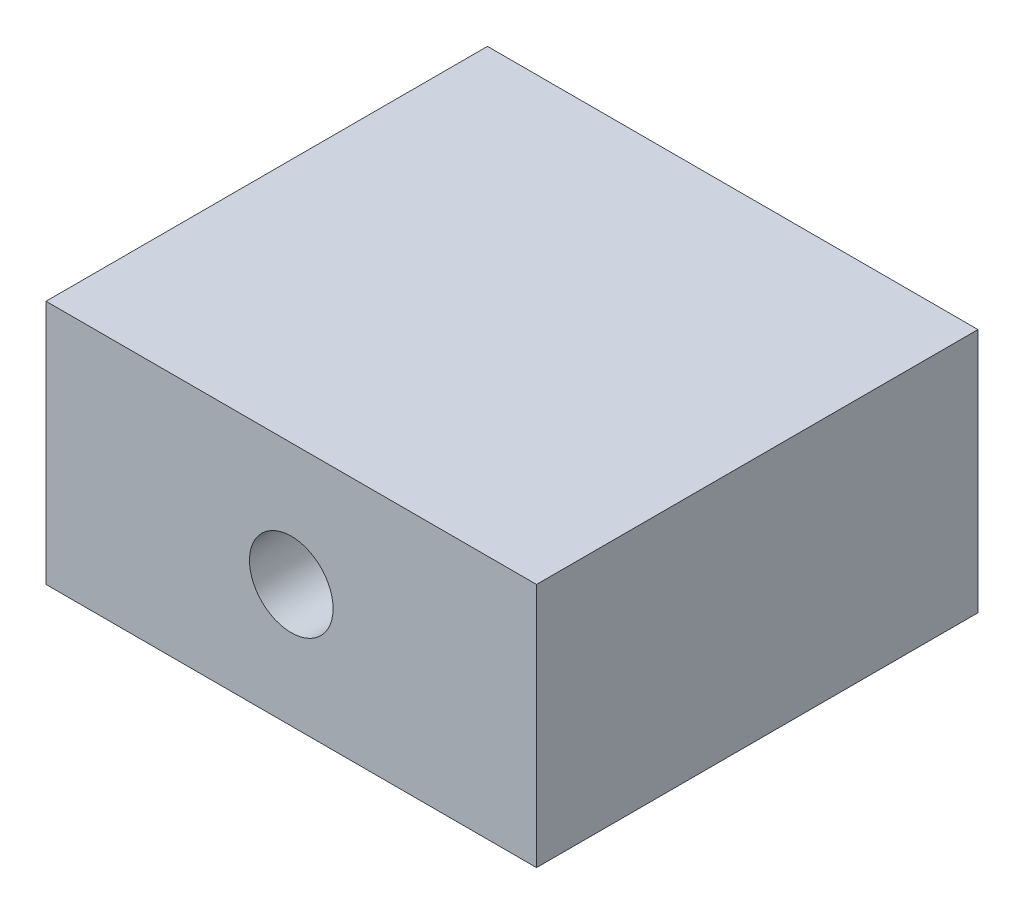
ISO-10303-21;
HEADER;
FILE_DESCRIPTION(('STEP AP214'),'2;1');
FILE_NAME('part.step','',(''),(''),'','','');
FILE_SCHEMA(('AUTOMOTIVE_DESIGN { 1 0 10303 214 1 1 1 1 }'));
ENDSEC;
DATA;
#1=APPLICATION_CONTEXT('core data for automotive mechanical design processes');
#2=APPLICATION_PROTOCOL_DEFINITION('international standard','automotive_design',2000,#1);
#3=PRODUCT_CONTEXT('',#1,'mechanical');
#4=PRODUCT('Part','Part','',(#3));
#5=PRODUCT_RELATED_PRODUCT_CATEGORY('part','',(#4));
#6=PRODUCT_DEFINITION_FORMATION('','',#4);
#7=PRODUCT_DEFINITION_CONTEXT('part definition',#1,'design');
#8=PRODUCT_DEFINITION('design','',#6,#7);
#9=PRODUCT_DEFINITION_SHAPE('','',#8);
#10=(LENGTH_UNIT() NAMED_UNIT(*) SI_UNIT(.MILLI.,.METRE.));
#11=(NAMED_UNIT(*) PLANE_ANGLE_UNIT() SI_UNIT($,.RADIAN.));
#12=(NAMED_UNIT(*) SI_UNIT($,.STERADIAN.) SOLID_ANGLE_UNIT());
#13=UNCERTAINTY_MEASURE_WITH_UNIT(LENGTH_MEASURE(1.E-05),#10,'distance_accuracy_value','');
#14=(GEOMETRIC_REPRESENTATION_CONTEXT(3) GLOBAL_UNCERTAINTY_ASSIGNED_CONTEXT((#13)) GLOBAL_UNIT_ASSIGNED_CONTEXT((#10,
#11,#12)) REPRESENTATION_CONTEXT('',''));
#15=CARTESIAN_POINT('',(0.,0.,0.));
#16=DIRECTION('',(0.,0.,1.));
#17=DIRECTION('',(1.,0.,0.));
#18=AXIS2_PLACEMENT_3D('',#15,#16,#17);
#19=CARTESIAN_POINT('',(0.,0.,0.));
#20=DIRECTION('',(0.,-1.,0.));
#21=DIRECTION('',(0.,0.,-1.));
#22=AXIS2_PLACEMENT_3D('',#19,#20,#21);
#23=PLANE('',#22);
#24=DIRECTION('',(-1.,0.,0.));
#25=VECTOR('',#24,1.);
#26=CARTESIAN_POINT('',(-28.,0.,20.));
#27=LINE('',#26,#25);
#28=CARTESIAN_POINT('',(-8.,0.,20.));
#29=VERTEX_POINT('',#28);
#30=CARTESIAN_POINT('',(-28.,0.,20.));
#31=VERTEX_POINT('',#30);
#32=EDGE_CURVE('E153',#29,#31,#27,.T.);
#33=ORIENTED_EDGE('',*,*,#32,.F.);
#34=DIRECTION('',(0.,0.,-1.));
#35=VECTOR('',#34,1.);
#36=CARTESIAN_POINT('',(-8.,0.,20.));
#37=LINE('',#36,#35);
#38=CARTESIAN_POINT('',(-8.,0.,38.));
#39=VERTEX_POINT('',#38);
#40=EDGE_CURVE('E86',#39,#29,#37,.T.);
#41=ORIENTED_EDGE('',*,*,#40,.F.);
#42=DIRECTION('',(1.,0.,0.));
#43=VECTOR('',#42,1.);
#44=CARTESIAN_POINT('',(-8.,0.,38.));
#45=LINE('',#44,#43);
#46=CARTESIAN_POINT('',(-28.,0.,38.));
#47=VERTEX_POINT('',#46);
#48=EDGE_CURVE('E171',#47,#39,#45,.T.);
#49=ORIENTED_EDGE('',*,*,#48,.F.);
#50=DIRECTION('',(0.,0.,1.));
#51=VECTOR('',#50,1.);
#52=CARTESIAN_POINT('',(-28.,0.,38.));
#53=LINE('',#52,#51);
#54=EDGE_CURVE('E168',#31,#47,#53,.T.);
#55=ORIENTED_EDGE('',*,*,#54,.F.);
#56=EDGE_LOOP('',(#33,#41,#49,#55));
#57=FACE_BOUND('',#56,.T.);
#58=DIRECTION('',(0.,0.,-1.));
#59=VECTOR('',#58,1.);
#60=CARTESIAN_POINT('',(-21.65,0.,31.));
#61=LINE('',#60,#59);
#62=CARTESIAN_POINT('',(-21.65,0.,31.));
#63=VERTEX_POINT('',#62);
#64=CARTESIAN_POINT('',(-21.65,0.,23.));
#65=VERTEX_POINT('',#64);
#66=EDGE_CURVE('E131',#63,#65,#61,.T.);
#67=ORIENTED_EDGE('',*,*,#66,.F.);
#68=DIRECTION('',(1.,0.,0.));
#69=VECTOR('',#68,1.);
#70=CARTESIAN_POINT('',(-21.65,0.,31.));
#71=LINE('',#70,#69);
#72=CARTESIAN_POINT('',(-14.35,0.,31.));
#73=VERTEX_POINT('',#72);
#74=EDGE_CURVE('E116',#63,#73,#71,.T.);
#75=ORIENTED_EDGE('',*,*,#74,.T.);
#76=DIRECTION('',(0.,0.,-1.));
#77=VECTOR('',#76,1.);
#78=CARTESIAN_POINT('',(-14.35,0.,31.));
#79=LINE('',#78,#77);
#80=CARTESIAN_POINT('',(-14.35,0.,23.));
#81=VERTEX_POINT('',#80);
#82=EDGE_CURVE('E140',#73,#81,#79,.T.);
#83=ORIENTED_EDGE('',*,*,#82,.T.);
#84=DIRECTION('',(1.,0.,0.));
#85=VECTOR('',#84,1.);
#86=CARTESIAN_POINT('',(-21.65,0.,23.));
#87=LINE('',#86,#85);
#88=EDGE_CURVE('E138',#65,#81,#87,.T.);
#89=ORIENTED_EDGE('',*,*,#88,.F.);
#90=EDGE_LOOP('',(#67,#75,#83,#89));
#91=FACE_BOUND('',#90,.T.);
#92=ADVANCED_FACE('F39',(#57,#91),#23,.T.);
#93=CARTESIAN_POINT('',(-18.,5.,23.));
#94=DIRECTION('',(0.,0.,1.));
#95=DIRECTION('',(1.,0.,0.));
#96=AXIS2_PLACEMENT_3D('',#93,#94,#95);
#97=CYLINDRICAL_SURFACE('',#96,1.705);
#98=CARTESIAN_POINT('',(-18.,5.,38.));
#99=DIRECTION('',(0.,0.,1.));
#100=DIRECTION('',(1.,0.,0.));
#101=AXIS2_PLACEMENT_3D('',#98,#99,#100);
#102=CIRCLE('',#101,1.705);
#103=CARTESIAN_POINT('',(-16.295,5.,38.));
#104=VERTEX_POINT('',#103);
#105=EDGE_CURVE('E145',#104,#104,#102,.T.);
#106=ORIENTED_EDGE('',*,*,#105,.T.);
#107=EDGE_LOOP('',(#106));
#108=FACE_BOUND('',#107,.T.);
#109=CARTESIAN_POINT('',(-18.,5.,31.));
#110=DIRECTION('',(0.,0.,-1.));
#111=DIRECTION('',(-1.,0.,0.));
#112=AXIS2_PLACEMENT_3D('',#109,#110,#111);
#113=CIRCLE('',#112,1.705);
#114=CARTESIAN_POINT('',(-19.705,5.,31.));
#115=VERTEX_POINT('',#114);
#116=EDGE_CURVE('E43',#115,#115,#113,.F.);
#117=ORIENTED_EDGE('',*,*,#116,.F.);
#118=EDGE_LOOP('',(#117));
#119=FACE_BOUND('',#118,.T.);
#120=ADVANCED_FACE('F207',(#108,#119),#97,.F.);
#121=CARTESIAN_POINT('',(-28.,10.,20.));
#122=DIRECTION('',(0.,0.,1.));
#123=DIRECTION('',(1.,0.,0.));
#124=AXIS2_PLACEMENT_3D('',#121,#122,#123);
#125=PLANE('',#124);
#126=ORIENTED_EDGE('',*,*,#32,.T.);
#127=DIRECTION('',(0.,-1.,0.));
#128=VECTOR('',#127,1.);
#129=CARTESIAN_POINT('',(-28.,10.,20.));
#130=LINE('',#129,#128);
#131=CARTESIAN_POINT('',(-28.,10.,20.));
#132=VERTEX_POINT('',#131);
#133=EDGE_CURVE('E11',#132,#31,#130,.T.);
#134=ORIENTED_EDGE('',*,*,#133,.F.);
#135=DIRECTION('',(-1.,0.,0.));
#136=VECTOR('',#135,1.);
#137=CARTESIAN_POINT('',(-28.,10.,20.));
#138=LINE('',#137,#136);
#139=CARTESIAN_POINT('',(-8.,10.,20.));
#140=VERTEX_POINT('',#139);
#141=EDGE_CURVE('E154',#140,#132,#138,.T.);
#142=ORIENTED_EDGE('',*,*,#141,.F.);
#143=DIRECTION('',(0.,-1.,0.));
#144=VECTOR('',#143,1.);
#145=CARTESIAN_POINT('',(-8.,10.,20.));
#146=LINE('',#145,#144);
#147=EDGE_CURVE('E164',#140,#29,#146,.T.);
#148=ORIENTED_EDGE('',*,*,#147,.T.);
#149=EDGE_LOOP('',(#126,#134,#142,#148));
#150=FACE_BOUND('',#149,.T.);
#151=ADVANCED_FACE('F41',(#150),#125,.F.);
#152=CARTESIAN_POINT('',(-28.,10.,38.));
#153=DIRECTION('',(1.,0.,0.));
#154=DIRECTION('',(0.,0.,-1.));
#155=AXIS2_PLACEMENT_3D('',#152,#153,#154);
#156=PLANE('',#155);
#157=ORIENTED_EDGE('',*,*,#54,.T.);
#158=DIRECTION('',(0.,-1.,0.));
#159=VECTOR('',#158,1.);
#160=CARTESIAN_POINT('',(-28.,10.,38.));
#161=LINE('',#160,#159);
#162=CARTESIAN_POINT('',(-28.,10.,38.));
#163=VERTEX_POINT('',#162);
#164=EDGE_CURVE('E49',#163,#47,#161,.T.);
#165=ORIENTED_EDGE('',*,*,#164,.F.);
#166=DIRECTION('',(0.,0.,1.));
#167=VECTOR('',#166,1.);
#168=CARTESIAN_POINT('',(-28.,10.,38.));
#169=LINE('',#168,#167);
#170=EDGE_CURVE('E93',#132,#163,#169,.T.);
#171=ORIENTED_EDGE('',*,*,#170,.F.);
#172=ORIENTED_EDGE('',*,*,#133,.T.);
#173=EDGE_LOOP('',(#157,#165,#171,#172));
#174=FACE_BOUND('',#173,.T.);
#175=ADVANCED_FACE('F202',(#174),#156,.F.);
#176=CARTESIAN_POINT('',(-8.,10.,38.));
#177=DIRECTION('',(0.,0.,-1.));
#178=DIRECTION('',(-1.,0.,0.));
#179=AXIS2_PLACEMENT_3D('',#176,#177,#178);
#180=PLANE('',#179);
#181=ORIENTED_EDGE('',*,*,#105,.F.);
#182=EDGE_LOOP('',(#181));
#183=FACE_BOUND('',#182,.T.);
#184=ORIENTED_EDGE('',*,*,#48,.T.);
#185=DIRECTION('',(0.,-1.,0.));
#186=VECTOR('',#185,1.);
#187=CARTESIAN_POINT('',(-8.,10.,38.));
#188=LINE('',#187,#186);
#189=CARTESIAN_POINT('',(-8.,10.,38.));
#190=VERTEX_POINT('',#189);
#191=EDGE_CURVE('E178',#190,#39,#188,.T.);
#192=ORIENTED_EDGE('',*,*,#191,.F.);
#193=DIRECTION('',(1.,0.,0.));
#194=VECTOR('',#193,1.);
#195=CARTESIAN_POINT('',(-8.,10.,38.));
#196=LINE('',#195,#194);
#197=EDGE_CURVE('E159',#163,#190,#196,.T.);
#198=ORIENTED_EDGE('',*,*,#197,.F.);
#199=ORIENTED_EDGE('',*,*,#164,.T.);
#200=EDGE_LOOP('',(#184,#192,#198,#199));
#201=FACE_BOUND('',#200,.T.);
#202=ADVANCED_FACE('F186',(#183,#201),#180,.F.);
#203=CARTESIAN_POINT('',(-8.,10.,20.));
#204=DIRECTION('',(-1.,0.,0.));
#205=DIRECTION('',(0.,0.,1.));
#206=AXIS2_PLACEMENT_3D('',#203,#204,#205);
#207=PLANE('',#206);
#208=ORIENTED_EDGE('',*,*,#40,.T.);
#209=ORIENTED_EDGE('',*,*,#147,.F.);
#210=DIRECTION('',(0.,0.,-1.));
#211=VECTOR('',#210,1.);
#212=CARTESIAN_POINT('',(-8.,10.,20.));
#213=LINE('',#212,#211);
#214=EDGE_CURVE('E65',#190,#140,#213,.T.);
#215=ORIENTED_EDGE('',*,*,#214,.F.);
#216=ORIENTED_EDGE('',*,*,#191,.T.);
#217=EDGE_LOOP('',(#208,#209,#215,#216));
#218=FACE_BOUND('',#217,.T.);
#219=ADVANCED_FACE('F193',(#218),#207,.F.);
#220=CARTESIAN_POINT('',(0.,10.,0.));
#221=DIRECTION('',(0.,-1.,0.));
#222=DIRECTION('',(0.,0.,-1.));
#223=AXIS2_PLACEMENT_3D('',#220,#221,#222);
#224=PLANE('',#223);
#225=ORIENTED_EDGE('',*,*,#141,.T.);
#226=ORIENTED_EDGE('',*,*,#170,.T.);
#227=ORIENTED_EDGE('',*,*,#197,.T.);
#228=ORIENTED_EDGE('',*,*,#214,.T.);
#229=EDGE_LOOP('',(#225,#226,#227,#228));
#230=FACE_BOUND('',#229,.T.);
#231=ADVANCED_FACE('F195',(#230),#224,.F.);
#232=CARTESIAN_POINT('',(0.,0.,31.));
#233=DIRECTION('',(0.,0.,-1.));
#234=DIRECTION('',(-1.,0.,0.));
#235=AXIS2_PLACEMENT_3D('',#232,#233,#234);
#236=PLANE('',#235);
#237=DIRECTION('',(0.,-1.,0.));
#238=VECTOR('',#237,1.);
#239=CARTESIAN_POINT('',(-21.65,0.,31.));
#240=LINE('',#239,#238);
#241=CARTESIAN_POINT('',(-21.65,8.65,31.));
#242=VERTEX_POINT('',#241);
#243=EDGE_CURVE('E121',#242,#63,#240,.T.);
#244=ORIENTED_EDGE('',*,*,#243,.F.);
#245=DIRECTION('',(-1.,0.,0.));
#246=VECTOR('',#245,1.);
#247=CARTESIAN_POINT('',(-21.65,8.65,31.));
#248=LINE('',#247,#246);
#249=CARTESIAN_POINT('',(-14.35,8.65,31.));
#250=VERTEX_POINT('',#249);
#251=EDGE_CURVE('E312',#250,#242,#248,.T.);
#252=ORIENTED_EDGE('',*,*,#251,.F.);
#253=DIRECTION('',(0.,1.,0.));
#254=VECTOR('',#253,1.);
#255=CARTESIAN_POINT('',(-14.35,0.,31.));
#256=LINE('',#255,#254);
#257=EDGE_CURVE('E122',#73,#250,#256,.T.);
#258=ORIENTED_EDGE('',*,*,#257,.F.);
#259=ORIENTED_EDGE('',*,*,#74,.F.);
#260=EDGE_LOOP('',(#244,#252,#258,#259));
#261=FACE_BOUND('',#260,.T.);
#262=ORIENTED_EDGE('',*,*,#116,.T.);
#263=EDGE_LOOP('',(#262));
#264=FACE_BOUND('',#263,.T.);
#265=ADVANCED_FACE('F118',(#261,#264),#236,.T.);
#266=CARTESIAN_POINT('',(-21.65,0.,31.));
#267=DIRECTION('',(1.,0.,0.));
#268=DIRECTION('',(0.,0.,-1.));
#269=AXIS2_PLACEMENT_3D('',#266,#267,#268);
#270=PLANE('',#269);
#271=DIRECTION('',(0.,-1.,0.));
#272=VECTOR('',#271,1.);
#273=CARTESIAN_POINT('',(-21.65,0.,23.));
#274=LINE('',#273,#272);
#275=CARTESIAN_POINT('',(-21.65,8.65,23.));
#276=VERTEX_POINT('',#275);
#277=EDGE_CURVE('E56',#276,#65,#274,.T.);
#278=ORIENTED_EDGE('',*,*,#277,.F.);
#279=DIRECTION('',(0.,0.,-1.));
#280=VECTOR('',#279,1.);
#281=CARTESIAN_POINT('',(-21.65,8.65,31.));
#282=LINE('',#281,#280);
#283=EDGE_CURVE('E134',#242,#276,#282,.T.);
#284=ORIENTED_EDGE('',*,*,#283,.F.);
#285=ORIENTED_EDGE('',*,*,#243,.T.);
#286=ORIENTED_EDGE('',*,*,#66,.T.);
#287=EDGE_LOOP('',(#278,#284,#285,#286));
#288=FACE_BOUND('',#287,.T.);
#289=ADVANCED_FACE('F130',(#288),#270,.T.);
#290=CARTESIAN_POINT('',(-14.35,0.,31.));
#291=DIRECTION('',(-1.,0.,0.));
#292=DIRECTION('',(0.,0.,1.));
#293=AXIS2_PLACEMENT_3D('',#290,#291,#292);
#294=PLANE('',#293);
#295=DIRECTION('',(0.,1.,0.));
#296=VECTOR('',#295,1.);
#297=CARTESIAN_POINT('',(-14.35,0.,23.));
#298=LINE('',#297,#296);
#299=CARTESIAN_POINT('',(-14.35,8.65,23.));
#300=VERTEX_POINT('',#299);
#301=EDGE_CURVE('E305',#81,#300,#298,.T.);
#302=ORIENTED_EDGE('',*,*,#301,.F.);
#303=ORIENTED_EDGE('',*,*,#82,.F.);
#304=ORIENTED_EDGE('',*,*,#257,.T.);
#305=DIRECTION('',(0.,0.,-1.));
#306=VECTOR('',#305,1.);
#307=CARTESIAN_POINT('',(-14.35,8.65,31.));
#308=LINE('',#307,#306);
#309=EDGE_CURVE('E146',#250,#300,#308,.T.);
#310=ORIENTED_EDGE('',*,*,#309,.T.);
#311=EDGE_LOOP('',(#302,#303,#304,#310));
#312=FACE_BOUND('',#311,.T.);
#313=ADVANCED_FACE('F220',(#312),#294,.T.);
#314=CARTESIAN_POINT('',(-21.65,8.65,31.));
#315=DIRECTION('',(0.,-1.,0.));
#316=DIRECTION('',(0.,0.,-1.));
#317=AXIS2_PLACEMENT_3D('',#314,#315,#316);
#318=PLANE('',#317);
#319=DIRECTION('',(-1.,0.,0.));
#320=VECTOR('',#319,1.);
#321=CARTESIAN_POINT('',(-21.65,8.65,23.));
#322=LINE('',#321,#320);
#323=EDGE_CURVE('E136',#300,#276,#322,.T.);
#324=ORIENTED_EDGE('',*,*,#323,.F.);
#325=ORIENTED_EDGE('',*,*,#309,.F.);
#326=ORIENTED_EDGE('',*,*,#251,.T.);
#327=ORIENTED_EDGE('',*,*,#283,.T.);
#328=EDGE_LOOP('',(#324,#325,#326,#327));
#329=FACE_BOUND('',#328,.T.);
#330=ADVANCED_FACE('F217',(#329),#318,.T.);
#331=CARTESIAN_POINT('',(-18.,5.,23.));
#332=DIRECTION('',(0.,0.,1.));
#333=DIRECTION('',(1.,0.,0.));
#334=AXIS2_PLACEMENT_3D('',#331,#332,#333);
#335=PLANE('',#334);
#336=ORIENTED_EDGE('',*,*,#277,.T.);
#337=ORIENTED_EDGE('',*,*,#88,.T.);
#338=ORIENTED_EDGE('',*,*,#301,.T.);
#339=ORIENTED_EDGE('',*,*,#323,.T.);
#340=EDGE_LOOP('',(#336,#337,#338,#339));
#341=FACE_BOUND('',#340,.T.);
#342=ADVANCED_FACE('F214',(#341),#335,.T.);
#343=CLOSED_SHELL('',(#92,#120,#151,#175,#202,#219,#231,#265,#289,#313,#330,#342));
#344=MANIFOLD_SOLID_BREP('B2',#343);
#345=ADVANCED_BREP_SHAPE_REPRESENTATION('',(#18,#344),#14);
#346=SHAPE_DEFINITION_REPRESENTATION(#9,#345);
ENDSEC;
END-ISO-10303-21;
